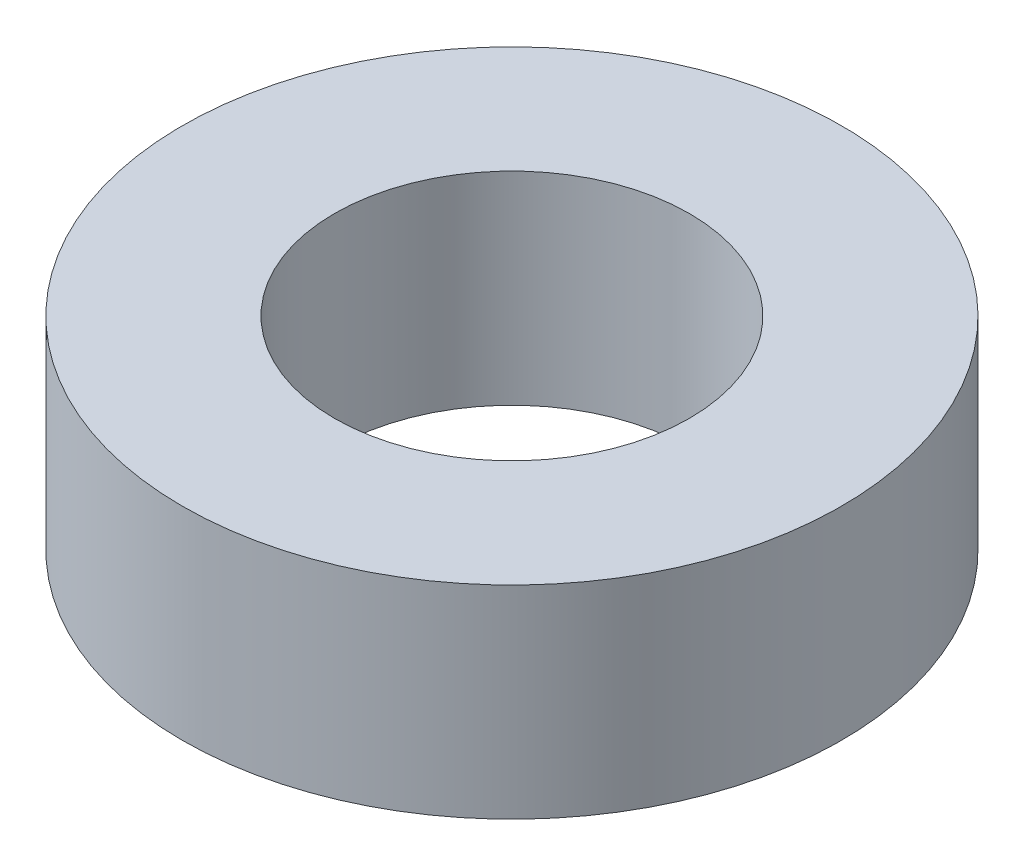
ISO-10303-21;
HEADER;
FILE_DESCRIPTION(('STEP AP214'),'2;1');
FILE_NAME('part.step','',(''),(''),'','','');
FILE_SCHEMA(('AUTOMOTIVE_DESIGN { 1 0 10303 214 1 1 1 1 }'));
ENDSEC;
DATA;
#1=APPLICATION_CONTEXT('core data for automotive mechanical design processes');
#2=APPLICATION_PROTOCOL_DEFINITION('international standard','automotive_design',2000,#1);
#3=PRODUCT_CONTEXT('',#1,'mechanical');
#4=PRODUCT('Part','Part','',(#3));
#5=PRODUCT_RELATED_PRODUCT_CATEGORY('part','',(#4));
#6=PRODUCT_DEFINITION_FORMATION('','',#4);
#7=PRODUCT_DEFINITION_CONTEXT('part definition',#1,'design');
#8=PRODUCT_DEFINITION('design','',#6,#7);
#9=PRODUCT_DEFINITION_SHAPE('','',#8);
#10=(LENGTH_UNIT() NAMED_UNIT(*) SI_UNIT(.MILLI.,.METRE.));
#11=(NAMED_UNIT(*) PLANE_ANGLE_UNIT() SI_UNIT($,.RADIAN.));
#12=(NAMED_UNIT(*) SI_UNIT($,.STERADIAN.) SOLID_ANGLE_UNIT());
#13=UNCERTAINTY_MEASURE_WITH_UNIT(LENGTH_MEASURE(1.E-05),#10,'distance_accuracy_value','');
#14=(GEOMETRIC_REPRESENTATION_CONTEXT(3) GLOBAL_UNCERTAINTY_ASSIGNED_CONTEXT((#13)) GLOBAL_UNIT_ASSIGNED_CONTEXT((#10,
#11,#12)) REPRESENTATION_CONTEXT('',''));
#15=CARTESIAN_POINT('',(0.,0.,0.));
#16=DIRECTION('',(0.,0.,1.));
#17=DIRECTION('',(1.,0.,0.));
#18=AXIS2_PLACEMENT_3D('',#15,#16,#17);
#19=CARTESIAN_POINT('',(0.,4.,0.));
#20=DIRECTION('',(0.,1.,0.));
#21=DIRECTION('',(0.,0.,1.));
#22=AXIS2_PLACEMENT_3D('',#19,#20,#21);
#23=PLANE('',#22);
#24=CARTESIAN_POINT('',(0.,4.,0.));
#25=DIRECTION('',(0.,1.,0.));
#26=DIRECTION('',(0.,0.,1.));
#27=AXIS2_PLACEMENT_3D('',#24,#25,#26);
#28=CIRCLE('',#27,6.5);
#29=CARTESIAN_POINT('',(0.,4.,6.5));
#30=VERTEX_POINT('',#29);
#31=EDGE_CURVE('E10',#30,#30,#28,.T.);
#32=ORIENTED_EDGE('',*,*,#31,.T.);
#33=EDGE_LOOP('',(#32));
#34=FACE_BOUND('',#33,.T.);
#35=CARTESIAN_POINT('',(0.,4.,0.));
#36=DIRECTION('',(0.,1.,0.));
#37=DIRECTION('',(0.,0.,1.));
#38=AXIS2_PLACEMENT_3D('',#35,#36,#37);
#39=CIRCLE('',#38,3.5);
#40=CARTESIAN_POINT('',(0.,4.,3.5));
#41=VERTEX_POINT('',#40);
#42=EDGE_CURVE('E42',#41,#41,#39,.T.);
#43=ORIENTED_EDGE('',*,*,#42,.F.);
#44=EDGE_LOOP('',(#43));
#45=FACE_BOUND('',#44,.T.);
#46=ADVANCED_FACE('F31',(#34,#45),#23,.T.);
#47=CARTESIAN_POINT('',(0.,0.,0.));
#48=DIRECTION('',(0.,1.,0.));
#49=DIRECTION('',(0.,0.,1.));
#50=AXIS2_PLACEMENT_3D('',#47,#48,#49);
#51=PLANE('',#50);
#52=CARTESIAN_POINT('',(0.,0.,0.));
#53=DIRECTION('',(0.,1.,0.));
#54=DIRECTION('',(0.,0.,1.));
#55=AXIS2_PLACEMENT_3D('',#52,#53,#54);
#56=CIRCLE('',#55,6.5);
#57=CARTESIAN_POINT('',(0.,0.,6.5));
#58=VERTEX_POINT('',#57);
#59=EDGE_CURVE('E35',#58,#58,#56,.T.);
#60=ORIENTED_EDGE('',*,*,#59,.F.);
#61=EDGE_LOOP('',(#60));
#62=FACE_BOUND('',#61,.T.);
#63=CARTESIAN_POINT('',(0.,0.,0.));
#64=DIRECTION('',(0.,1.,0.));
#65=DIRECTION('',(0.,0.,1.));
#66=AXIS2_PLACEMENT_3D('',#63,#64,#65);
#67=CIRCLE('',#66,3.5);
#68=CARTESIAN_POINT('',(0.,0.,3.5));
#69=VERTEX_POINT('',#68);
#70=EDGE_CURVE('E44',#69,#69,#67,.T.);
#71=ORIENTED_EDGE('',*,*,#70,.T.);
#72=EDGE_LOOP('',(#71));
#73=FACE_BOUND('',#72,.T.);
#74=ADVANCED_FACE('F54',(#62,#73),#51,.F.);
#75=CARTESIAN_POINT('',(0.,4.,0.));
#76=DIRECTION('',(0.,-1.,0.));
#77=DIRECTION('',(0.,0.,-1.));
#78=AXIS2_PLACEMENT_3D('',#75,#76,#77);
#79=CYLINDRICAL_SURFACE('',#78,6.5);
#80=ORIENTED_EDGE('',*,*,#31,.F.);
#81=EDGE_LOOP('',(#80));
#82=FACE_BOUND('',#81,.T.);
#83=ORIENTED_EDGE('',*,*,#59,.T.);
#84=EDGE_LOOP('',(#83));
#85=FACE_BOUND('',#84,.T.);
#86=ADVANCED_FACE('F33',(#82,#85),#79,.T.);
#87=CARTESIAN_POINT('',(0.,4.,0.));
#88=DIRECTION('',(0.,-1.,0.));
#89=DIRECTION('',(0.,0.,-1.));
#90=AXIS2_PLACEMENT_3D('',#87,#88,#89);
#91=CYLINDRICAL_SURFACE('',#90,3.5);
#92=ORIENTED_EDGE('',*,*,#42,.T.);
#93=EDGE_LOOP('',(#92));
#94=FACE_BOUND('',#93,.T.);
#95=ORIENTED_EDGE('',*,*,#70,.F.);
#96=EDGE_LOOP('',(#95));
#97=FACE_BOUND('',#96,.T.);
#98=ADVANCED_FACE('F50',(#94,#97),#91,.F.);
#99=CLOSED_SHELL('',(#46,#74,#86,#98));
#100=MANIFOLD_SOLID_BREP('B2',#99);
#101=ADVANCED_BREP_SHAPE_REPRESENTATION('',(#18,#100),#14);
#102=SHAPE_DEFINITION_REPRESENTATION(#9,#101);
ENDSEC;
END-ISO-10303-21;
